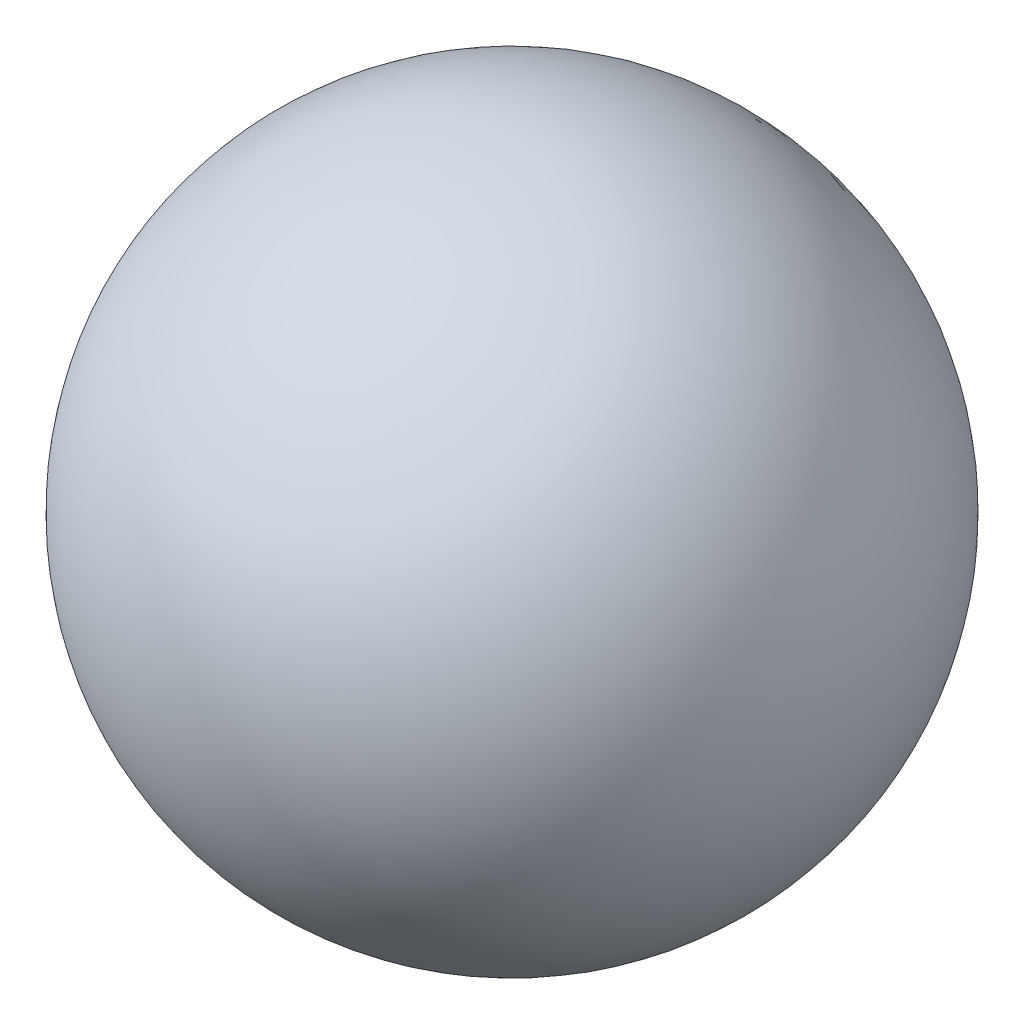
ISO-10303-21;
HEADER;
FILE_DESCRIPTION(('STEP AP214'),'2;1');
FILE_NAME('part.step','',(''),(''),'','','');
FILE_SCHEMA(('AUTOMOTIVE_DESIGN { 1 0 10303 214 1 1 1 1 }'));
ENDSEC;
DATA;
#1=APPLICATION_CONTEXT('core data for automotive mechanical design processes');
#2=APPLICATION_PROTOCOL_DEFINITION('international standard','automotive_design',2000,#1);
#3=PRODUCT_CONTEXT('',#1,'mechanical');
#4=PRODUCT('Part','Part','',(#3));
#5=PRODUCT_RELATED_PRODUCT_CATEGORY('part','',(#4));
#6=PRODUCT_DEFINITION_FORMATION('','',#4);
#7=PRODUCT_DEFINITION_CONTEXT('part definition',#1,'design');
#8=PRODUCT_DEFINITION('design','',#6,#7);
#9=PRODUCT_DEFINITION_SHAPE('','',#8);
#10=(LENGTH_UNIT() NAMED_UNIT(*) SI_UNIT(.MILLI.,.METRE.));
#11=(NAMED_UNIT(*) PLANE_ANGLE_UNIT() SI_UNIT($,.RADIAN.));
#12=(NAMED_UNIT(*) SI_UNIT($,.STERADIAN.) SOLID_ANGLE_UNIT());
#13=UNCERTAINTY_MEASURE_WITH_UNIT(LENGTH_MEASURE(1.E-05),#10,'distance_accuracy_value','');
#14=(GEOMETRIC_REPRESENTATION_CONTEXT(3) GLOBAL_UNCERTAINTY_ASSIGNED_CONTEXT((#13)) GLOBAL_UNIT_ASSIGNED_CONTEXT((#10,
#11,#12)) REPRESENTATION_CONTEXT('',''));
#15=CARTESIAN_POINT('',(0.,0.,0.));
#16=DIRECTION('',(0.,0.,1.));
#17=DIRECTION('',(1.,0.,0.));
#18=AXIS2_PLACEMENT_3D('',#15,#16,#17);
#19=CARTESIAN_POINT('',(64.16,-50.2923932754782,-47.7982831033154));
#20=DIRECTION('',(0.,-0.724851812050192,-0.688904819672183));
#21=DIRECTION('',(0.173648177666934,0.67843880750064,-0.713839684291972));
#22=AXIS2_PLACEMENT_3D('',#19,#20,#21);
#23=SPHERICAL_SURFACE('',#22,7.15);
#24=CARTESIAN_POINT('',(64.16,-45.1097028193194,-42.8726136426591));
#25=VERTEX_POINT('',#24);
#26=VERTEX_LOOP('',#25);
#27=FACE_BOUND('',#26,.T.);
#28=CARTESIAN_POINT('',(64.16,-55.475083731637,-52.7239525639715));
#29=VERTEX_POINT('',#28);
#30=VERTEX_LOOP('',#29);
#31=FACE_BOUND('',#30,.T.);
#32=ADVANCED_FACE('F19',(#27,#31),#23,.T.);
#33=CLOSED_SHELL('',(#32));
#34=MANIFOLD_SOLID_BREP('B1',#33);
#35=ADVANCED_BREP_SHAPE_REPRESENTATION('',(#18,#34),#14);
#36=SHAPE_DEFINITION_REPRESENTATION(#9,#35);
ENDSEC;
END-ISO-10303-21;
